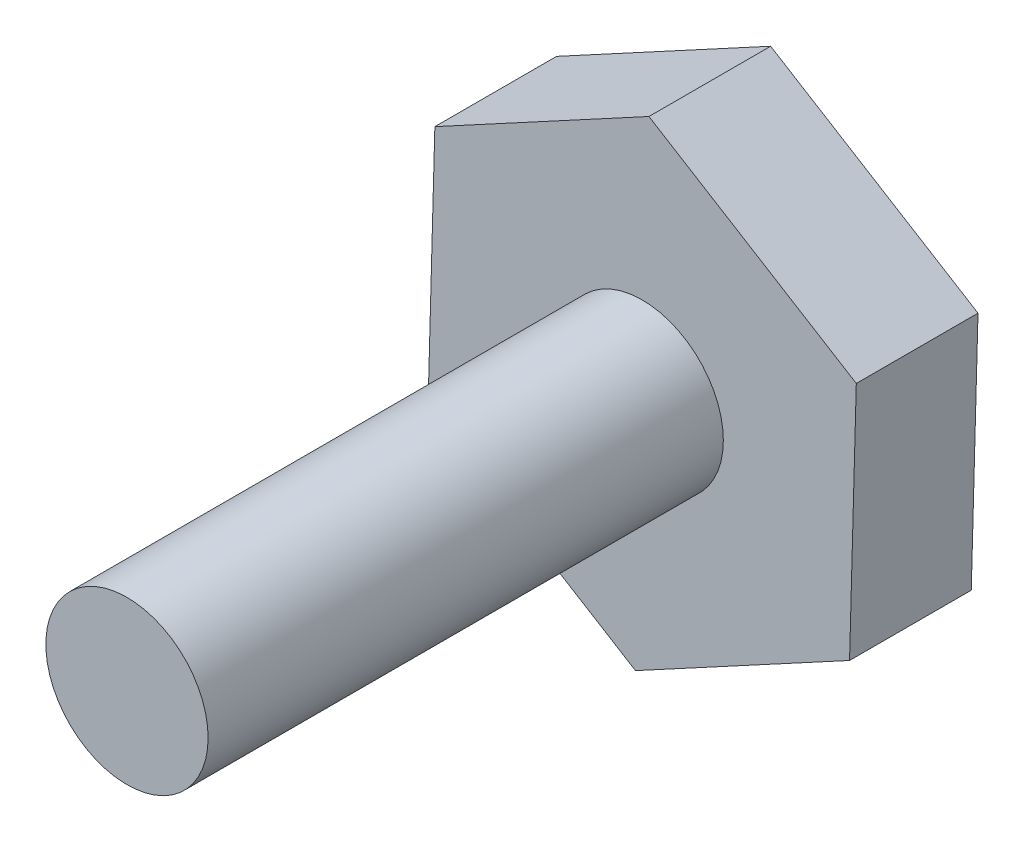
ISO-10303-21;
HEADER;
FILE_DESCRIPTION(('STEP AP214'),'2;1');
FILE_NAME('part.step','',(''),(''),'','','');
FILE_SCHEMA(('AUTOMOTIVE_DESIGN { 1 0 10303 214 1 1 1 1 }'));
ENDSEC;
DATA;
#1=APPLICATION_CONTEXT('core data for automotive mechanical design processes');
#2=APPLICATION_PROTOCOL_DEFINITION('international standard','automotive_design',2000,#1);
#3=PRODUCT_CONTEXT('',#1,'mechanical');
#4=PRODUCT('Part','Part','',(#3));
#5=PRODUCT_RELATED_PRODUCT_CATEGORY('part','',(#4));
#6=PRODUCT_DEFINITION_FORMATION('','',#4);
#7=PRODUCT_DEFINITION_CONTEXT('part definition',#1,'design');
#8=PRODUCT_DEFINITION('design','',#6,#7);
#9=PRODUCT_DEFINITION_SHAPE('','',#8);
#10=(LENGTH_UNIT() NAMED_UNIT(*) SI_UNIT(.MILLI.,.METRE.));
#11=(NAMED_UNIT(*) PLANE_ANGLE_UNIT() SI_UNIT($,.RADIAN.));
#12=(NAMED_UNIT(*) SI_UNIT($,.STERADIAN.) SOLID_ANGLE_UNIT());
#13=UNCERTAINTY_MEASURE_WITH_UNIT(LENGTH_MEASURE(1.E-05),#10,'distance_accuracy_value','');
#14=(GEOMETRIC_REPRESENTATION_CONTEXT(3) GLOBAL_UNCERTAINTY_ASSIGNED_CONTEXT((#13)) GLOBAL_UNIT_ASSIGNED_CONTEXT((#10,
#11,#12)) REPRESENTATION_CONTEXT('',''));
#15=CARTESIAN_POINT('',(0.,0.,0.));
#16=DIRECTION('',(0.,0.,1.));
#17=DIRECTION('',(1.,0.,0.));
#18=AXIS2_PLACEMENT_3D('',#15,#16,#17);
#19=CARTESIAN_POINT('',(5.11105623467221,-3.142786051582,3.));
#20=DIRECTION('',(-0.999616260864661,0.0277007403322154,0.));
#21=DIRECTION('',(-0.0277007403322154,-0.999616260864662,0.));
#22=AXIS2_PLACEMENT_3D('',#19,#20,#21);
#23=PLANE('',#22);
#24=DIRECTION('',(0.0277007403322154,0.999616260864661,0.));
#25=VECTOR('',#24,1.);
#26=CARTESIAN_POINT('',(5.11105623467221,-3.142786051582,0.));
#27=LINE('',#26,#25);
#28=CARTESIAN_POINT('',(5.11105623467221,-3.142786051582,0.));
#29=VERTEX_POINT('',#28);
#30=CARTESIAN_POINT('',(5.27726067666551,2.85491151360598,0.));
#31=VERTEX_POINT('',#30);
#32=EDGE_CURVE('E130',#29,#31,#27,.T.);
#33=ORIENTED_EDGE('',*,*,#32,.T.);
#34=DIRECTION('',(0.,0.,-1.));
#35=VECTOR('',#34,1.);
#36=CARTESIAN_POINT('',(5.27726067666551,2.85491151360598,3.));
#37=LINE('',#36,#35);
#38=CARTESIAN_POINT('',(5.27726067666551,2.85491151360598,3.));
#39=VERTEX_POINT('',#38);
#40=EDGE_CURVE('E42',#39,#31,#37,.T.);
#41=ORIENTED_EDGE('',*,*,#40,.F.);
#42=DIRECTION('',(0.0277007403322154,0.999616260864661,0.));
#43=VECTOR('',#42,1.);
#44=CARTESIAN_POINT('',(5.11105623467221,-3.142786051582,3.));
#45=LINE('',#44,#43);
#46=CARTESIAN_POINT('',(5.11105623467221,-3.142786051582,3.));
#47=VERTEX_POINT('',#46);
#48=EDGE_CURVE('E147',#47,#39,#45,.T.);
#49=ORIENTED_EDGE('',*,*,#48,.F.);
#50=DIRECTION('',(0.,0.,-1.));
#51=VECTOR('',#50,1.);
#52=CARTESIAN_POINT('',(5.11105623467221,-3.142786051582,3.));
#53=LINE('',#52,#51);
#54=EDGE_CURVE('E126',#47,#29,#53,.T.);
#55=ORIENTED_EDGE('',*,*,#54,.T.);
#56=EDGE_LOOP('',(#33,#41,#49,#55));
#57=FACE_BOUND('',#56,.T.);
#58=ADVANCED_FACE('F39',(#57),#23,.F.);
#59=CARTESIAN_POINT('',(5.27726067666551,2.85491151360598,3.));
#60=DIRECTION('',(-0.523797675263666,-0.851842705778702,0.));
#61=DIRECTION('',(0.851842705778702,-0.523797675263666,0.));
#62=AXIS2_PLACEMENT_3D('',#59,#60,#61);
#63=PLANE('',#62);
#64=DIRECTION('',(-0.851842705778701,0.523797675263666,0.));
#65=VECTOR('',#64,1.);
#66=CARTESIAN_POINT('',(5.27726067666551,2.85491151360598,0.));
#67=LINE('',#66,#65);
#68=CARTESIAN_POINT('',(0.166204441993295,5.99769756518797,0.));
#69=VERTEX_POINT('',#68);
#70=EDGE_CURVE('E134',#31,#69,#67,.T.);
#71=ORIENTED_EDGE('',*,*,#70,.T.);
#72=DIRECTION('',(0.,0.,-1.));
#73=VECTOR('',#72,1.);
#74=CARTESIAN_POINT('',(0.166204441993295,5.99769756518797,3.));
#75=LINE('',#74,#73);
#76=CARTESIAN_POINT('',(0.166204441993295,5.99769756518797,3.));
#77=VERTEX_POINT('',#76);
#78=EDGE_CURVE('E153',#77,#69,#75,.T.);
#79=ORIENTED_EDGE('',*,*,#78,.F.);
#80=DIRECTION('',(-0.851842705778701,0.523797675263666,0.));
#81=VECTOR('',#80,1.);
#82=CARTESIAN_POINT('',(5.27726067666551,2.85491151360598,3.));
#83=LINE('',#82,#81);
#84=EDGE_CURVE('E95',#39,#77,#83,.T.);
#85=ORIENTED_EDGE('',*,*,#84,.F.);
#86=ORIENTED_EDGE('',*,*,#40,.T.);
#87=EDGE_LOOP('',(#71,#79,#85,#86));
#88=FACE_BOUND('',#87,.T.);
#89=ADVANCED_FACE('F160',(#88),#63,.F.);
#90=CARTESIAN_POINT('',(0.166204441993295,5.99769756518797,3.));
#91=DIRECTION('',(0.475818585600996,-0.879543446110917,0.));
#92=DIRECTION('',(0.879543446110917,0.475818585600996,0.));
#93=AXIS2_PLACEMENT_3D('',#90,#91,#92);
#94=PLANE('',#93);
#95=DIRECTION('',(-0.879543446110917,-0.475818585600996,0.));
#96=VECTOR('',#95,1.);
#97=CARTESIAN_POINT('',(0.166204441993295,5.99769756518797,0.));
#98=LINE('',#97,#96);
#99=CARTESIAN_POINT('',(-5.11105623467221,3.142786051582,0.));
#100=VERTEX_POINT('',#99);
#101=EDGE_CURVE('E138',#69,#100,#98,.T.);
#102=ORIENTED_EDGE('',*,*,#101,.T.);
#103=DIRECTION('',(0.,0.,-1.));
#104=VECTOR('',#103,1.);
#105=CARTESIAN_POINT('',(-5.11105623467221,3.142786051582,3.));
#106=LINE('',#105,#104);
#107=CARTESIAN_POINT('',(-5.11105623467221,3.142786051582,3.));
#108=VERTEX_POINT('',#107);
#109=EDGE_CURVE('E119',#108,#100,#106,.T.);
#110=ORIENTED_EDGE('',*,*,#109,.F.);
#111=DIRECTION('',(-0.879543446110917,-0.475818585600996,0.));
#112=VECTOR('',#111,1.);
#113=CARTESIAN_POINT('',(0.166204441993295,5.99769756518797,3.));
#114=LINE('',#113,#112);
#115=EDGE_CURVE('E108',#77,#108,#114,.T.);
#116=ORIENTED_EDGE('',*,*,#115,.F.);
#117=ORIENTED_EDGE('',*,*,#78,.T.);
#118=EDGE_LOOP('',(#102,#110,#116,#117));
#119=FACE_BOUND('',#118,.T.);
#120=ADVANCED_FACE('F166',(#119),#94,.F.);
#121=CARTESIAN_POINT('',(-5.11105623467221,3.142786051582,3.));
#122=DIRECTION('',(0.999616260864661,-0.0277007403322154,0.));
#123=DIRECTION('',(0.0277007403322154,0.999616260864662,0.));
#124=AXIS2_PLACEMENT_3D('',#121,#122,#123);
#125=PLANE('',#124);
#126=DIRECTION('',(-0.0277007403322154,-0.999616260864661,0.));
#127=VECTOR('',#126,1.);
#128=CARTESIAN_POINT('',(-5.11105623467221,3.142786051582,0.));
#129=LINE('',#128,#127);
#130=CARTESIAN_POINT('',(-5.2772606766655,-2.85491151360598,0.));
#131=VERTEX_POINT('',#130);
#132=EDGE_CURVE('E117',#100,#131,#129,.T.);
#133=ORIENTED_EDGE('',*,*,#132,.T.);
#134=DIRECTION('',(0.,0.,-1.));
#135=VECTOR('',#134,1.);
#136=CARTESIAN_POINT('',(-5.2772606766655,-2.85491151360598,3.));
#137=LINE('',#136,#135);
#138=CARTESIAN_POINT('',(-5.2772606766655,-2.85491151360598,3.));
#139=VERTEX_POINT('',#138);
#140=EDGE_CURVE('E114',#139,#131,#137,.T.);
#141=ORIENTED_EDGE('',*,*,#140,.F.);
#142=DIRECTION('',(-0.0277007403322154,-0.999616260864661,0.));
#143=VECTOR('',#142,1.);
#144=CARTESIAN_POINT('',(-5.11105623467221,3.142786051582,3.));
#145=LINE('',#144,#143);
#146=EDGE_CURVE('E102',#108,#139,#145,.T.);
#147=ORIENTED_EDGE('',*,*,#146,.F.);
#148=ORIENTED_EDGE('',*,*,#109,.T.);
#149=EDGE_LOOP('',(#133,#141,#147,#148));
#150=FACE_BOUND('',#149,.T.);
#151=ADVANCED_FACE('F115',(#150),#125,.F.);
#152=CARTESIAN_POINT('',(-5.2772606766655,-2.85491151360598,3.));
#153=DIRECTION('',(0.523797675263666,0.851842705778701,0.));
#154=DIRECTION('',(-0.851842705778701,0.523797675263666,0.));
#155=AXIS2_PLACEMENT_3D('',#152,#153,#154);
#156=PLANE('',#155);
#157=DIRECTION('',(0.851842705778701,-0.523797675263666,0.));
#158=VECTOR('',#157,1.);
#159=CARTESIAN_POINT('',(-5.2772606766655,-2.85491151360598,0.));
#160=LINE('',#159,#158);
#161=CARTESIAN_POINT('',(-0.16620444199329,-5.99769756518797,0.));
#162=VERTEX_POINT('',#161);
#163=EDGE_CURVE('E80',#131,#162,#160,.T.);
#164=ORIENTED_EDGE('',*,*,#163,.T.);
#165=DIRECTION('',(0.,0.,-1.));
#166=VECTOR('',#165,1.);
#167=CARTESIAN_POINT('',(-0.16620444199329,-5.99769756518797,3.));
#168=LINE('',#167,#166);
#169=CARTESIAN_POINT('',(-0.16620444199329,-5.99769756518797,3.));
#170=VERTEX_POINT('',#169);
#171=EDGE_CURVE('E120',#170,#162,#168,.T.);
#172=ORIENTED_EDGE('',*,*,#171,.F.);
#173=DIRECTION('',(0.851842705778701,-0.523797675263666,0.));
#174=VECTOR('',#173,1.);
#175=CARTESIAN_POINT('',(-5.2772606766655,-2.85491151360598,3.));
#176=LINE('',#175,#174);
#177=EDGE_CURVE('E106',#139,#170,#176,.T.);
#178=ORIENTED_EDGE('',*,*,#177,.F.);
#179=ORIENTED_EDGE('',*,*,#140,.T.);
#180=EDGE_LOOP('',(#164,#172,#178,#179));
#181=FACE_BOUND('',#180,.T.);
#182=ADVANCED_FACE('F122',(#181),#156,.F.);
#183=CARTESIAN_POINT('',(-0.16620444199329,-5.99769756518797,3.));
#184=DIRECTION('',(-0.475818585600996,0.879543446110917,0.));
#185=DIRECTION('',(-0.879543446110917,-0.475818585600996,0.));
#186=AXIS2_PLACEMENT_3D('',#183,#184,#185);
#187=PLANE('',#186);
#188=DIRECTION('',(0.879543446110917,0.475818585600996,0.));
#189=VECTOR('',#188,1.);
#190=CARTESIAN_POINT('',(-0.16620444199329,-5.99769756518797,0.));
#191=LINE('',#190,#189);
#192=EDGE_CURVE('E86',#162,#29,#191,.T.);
#193=ORIENTED_EDGE('',*,*,#192,.T.);
#194=ORIENTED_EDGE('',*,*,#54,.F.);
#195=DIRECTION('',(0.879543446110917,0.475818585600996,0.));
#196=VECTOR('',#195,1.);
#197=CARTESIAN_POINT('',(-0.16620444199329,-5.99769756518797,3.));
#198=LINE('',#197,#196);
#199=EDGE_CURVE('E57',#170,#47,#198,.T.);
#200=ORIENTED_EDGE('',*,*,#199,.F.);
#201=ORIENTED_EDGE('',*,*,#171,.T.);
#202=EDGE_LOOP('',(#193,#194,#200,#201));
#203=FACE_BOUND('',#202,.T.);
#204=ADVANCED_FACE('F186',(#203),#187,.F.);
#205=CARTESIAN_POINT('',(0.,0.,3.));
#206=DIRECTION('',(0.,0.,1.));
#207=DIRECTION('',(1.,0.,0.));
#208=AXIS2_PLACEMENT_3D('',#205,#206,#207);
#209=PLANE('',#208);
#210=CARTESIAN_POINT('',(0.,0.,3.));
#211=DIRECTION('',(0.,0.,1.));
#212=DIRECTION('',(1.,0.,0.));
#213=AXIS2_PLACEMENT_3D('',#210,#211,#212);
#214=CIRCLE('',#213,2.);
#215=CARTESIAN_POINT('',(2.,0.,3.));
#216=VERTEX_POINT('',#215);
#217=EDGE_CURVE('E11',#216,#216,#214,.T.);
#218=ORIENTED_EDGE('',*,*,#217,.F.);
#219=EDGE_LOOP('',(#218));
#220=FACE_BOUND('',#219,.T.);
#221=ORIENTED_EDGE('',*,*,#48,.T.);
#222=ORIENTED_EDGE('',*,*,#84,.T.);
#223=ORIENTED_EDGE('',*,*,#115,.T.);
#224=ORIENTED_EDGE('',*,*,#146,.T.);
#225=ORIENTED_EDGE('',*,*,#177,.T.);
#226=ORIENTED_EDGE('',*,*,#199,.T.);
#227=EDGE_LOOP('',(#221,#222,#223,#224,#225,#226));
#228=FACE_BOUND('',#227,.T.);
#229=ADVANCED_FACE('F104',(#220,#228),#209,.T.);
#230=CARTESIAN_POINT('',(0.,0.,0.));
#231=DIRECTION('',(0.,0.,1.));
#232=DIRECTION('',(1.,0.,0.));
#233=AXIS2_PLACEMENT_3D('',#230,#231,#232);
#234=PLANE('',#233);
#235=ORIENTED_EDGE('',*,*,#32,.F.);
#236=ORIENTED_EDGE('',*,*,#192,.F.);
#237=ORIENTED_EDGE('',*,*,#163,.F.);
#238=ORIENTED_EDGE('',*,*,#132,.F.);
#239=ORIENTED_EDGE('',*,*,#101,.F.);
#240=ORIENTED_EDGE('',*,*,#70,.F.);
#241=EDGE_LOOP('',(#235,#236,#237,#238,#239,#240));
#242=FACE_BOUND('',#241,.T.);
#243=ADVANCED_FACE('F165',(#242),#234,.F.);
#244=CARTESIAN_POINT('',(0.,0.,15.7));
#245=DIRECTION('',(0.,0.,-1.));
#246=DIRECTION('',(-1.,0.,0.));
#247=AXIS2_PLACEMENT_3D('',#244,#245,#246);
#248=CYLINDRICAL_SURFACE('',#247,2.);
#249=CARTESIAN_POINT('',(0.,0.,15.7));
#250=DIRECTION('',(0.,0.,1.));
#251=DIRECTION('',(1.,0.,0.));
#252=AXIS2_PLACEMENT_3D('',#249,#250,#251);
#253=CIRCLE('',#252,2.);
#254=CARTESIAN_POINT('',(2.,0.,15.7));
#255=VERTEX_POINT('',#254);
#256=EDGE_CURVE('E135',#255,#255,#253,.T.);
#257=ORIENTED_EDGE('',*,*,#256,.F.);
#258=EDGE_LOOP('',(#257));
#259=FACE_BOUND('',#258,.T.);
#260=ORIENTED_EDGE('',*,*,#217,.T.);
#261=EDGE_LOOP('',(#260));
#262=FACE_BOUND('',#261,.T.);
#263=ADVANCED_FACE('F179',(#259,#262),#248,.T.);
#264=CARTESIAN_POINT('',(0.,0.,15.7));
#265=DIRECTION('',(0.,0.,1.));
#266=DIRECTION('',(1.,0.,0.));
#267=AXIS2_PLACEMENT_3D('',#264,#265,#266);
#268=PLANE('',#267);
#269=ORIENTED_EDGE('',*,*,#256,.T.);
#270=EDGE_LOOP('',(#269));
#271=FACE_BOUND('',#270,.T.);
#272=ADVANCED_FACE('F177',(#271),#268,.T.);
#273=CLOSED_SHELL('',(#58,#89,#120,#151,#182,#204,#229,#243,#263,#272));
#274=MANIFOLD_SOLID_BREP('B2',#273);
#275=ADVANCED_BREP_SHAPE_REPRESENTATION('',(#18,#274),#14);
#276=SHAPE_DEFINITION_REPRESENTATION(#9,#275);
ENDSEC;
END-ISO-10303-21;
